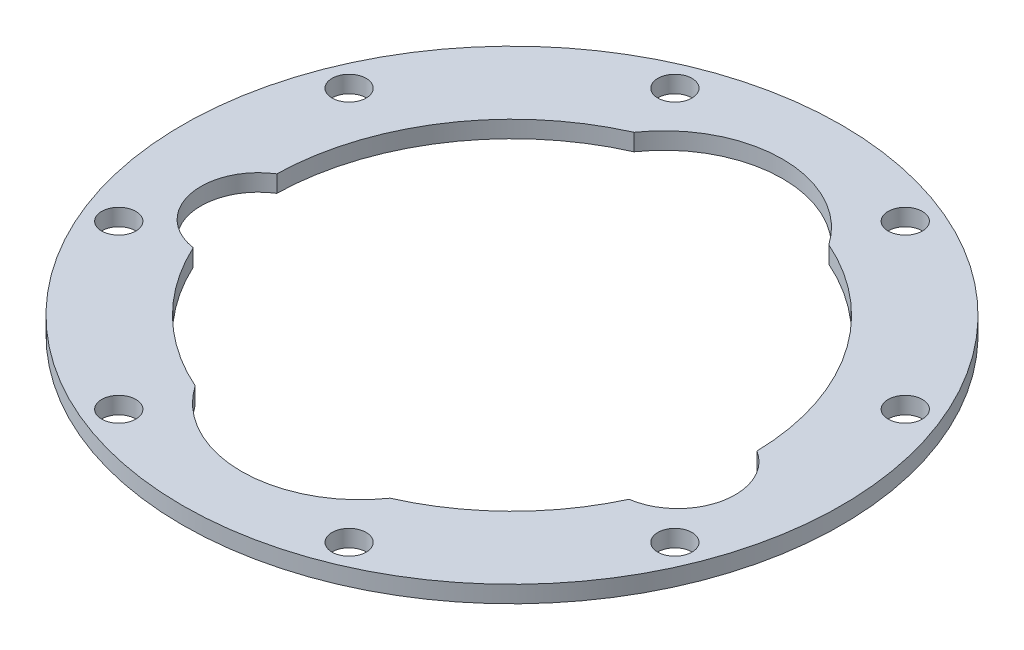
ISO-10303-21;
HEADER;
FILE_DESCRIPTION(('STEP AP214'),'2;1');
FILE_NAME('part.step','',(''),(''),'','','');
FILE_SCHEMA(('AUTOMOTIVE_DESIGN { 1 0 10303 214 1 1 1 1 }'));
ENDSEC;
DATA;
#1=APPLICATION_CONTEXT('core data for automotive mechanical design processes');
#2=APPLICATION_PROTOCOL_DEFINITION('international standard','automotive_design',2000,#1);
#3=PRODUCT_CONTEXT('',#1,'mechanical');
#4=PRODUCT('Part','Part','',(#3));
#5=PRODUCT_RELATED_PRODUCT_CATEGORY('part','',(#4));
#6=PRODUCT_DEFINITION_FORMATION('','',#4);
#7=PRODUCT_DEFINITION_CONTEXT('part definition',#1,'design');
#8=PRODUCT_DEFINITION('design','',#6,#7);
#9=PRODUCT_DEFINITION_SHAPE('','',#8);
#10=(LENGTH_UNIT() NAMED_UNIT(*) SI_UNIT(.MILLI.,.METRE.));
#11=(NAMED_UNIT(*) PLANE_ANGLE_UNIT() SI_UNIT($,.RADIAN.));
#12=(NAMED_UNIT(*) SI_UNIT($,.STERADIAN.) SOLID_ANGLE_UNIT());
#13=UNCERTAINTY_MEASURE_WITH_UNIT(LENGTH_MEASURE(1.E-05),#10,'distance_accuracy_value','');
#14=(GEOMETRIC_REPRESENTATION_CONTEXT(3) GLOBAL_UNCERTAINTY_ASSIGNED_CONTEXT((#13)) GLOBAL_UNIT_ASSIGNED_CONTEXT((#10,
#11,#12)) REPRESENTATION_CONTEXT('',''));
#15=CARTESIAN_POINT('',(0.,0.,0.));
#16=DIRECTION('',(0.,0.,1.));
#17=DIRECTION('',(1.,0.,0.));
#18=AXIS2_PLACEMENT_3D('',#15,#16,#17);
#19=CARTESIAN_POINT('',(0.,5.,0.));
#20=DIRECTION('',(0.,-1.,0.));
#21=DIRECTION('',(0.,0.,-1.));
#22=AXIS2_PLACEMENT_3D('',#19,#20,#21);
#23=CYLINDRICAL_SURFACE('',#22,71.);
#24=CARTESIAN_POINT('',(0.,0.,0.));
#25=DIRECTION('',(0.,1.,0.));
#26=DIRECTION('',(0.,0.,1.));
#27=AXIS2_PLACEMENT_3D('',#24,#25,#26);
#28=CIRCLE('',#27,71.);
#29=CARTESIAN_POINT('',(-28.7921864400743,0.,-64.9));
#30=VERTEX_POINT('',#29);
#31=CARTESIAN_POINT('',(-70.9855736985832,0.,-1.43119763939675));
#32=VERTEX_POINT('',#31);
#33=EDGE_CURVE('E196',#30,#32,#28,.T.);
#34=ORIENTED_EDGE('',*,*,#33,.F.);
#35=DIRECTION('',(0.,-1.,0.));
#36=VECTOR('',#35,1.);
#37=CARTESIAN_POINT('',(-28.7921864400743,5.,-64.9));
#38=LINE('',#37,#36);
#39=CARTESIAN_POINT('',(-28.7921864400743,5.,-64.9));
#40=VERTEX_POINT('',#39);
#41=EDGE_CURVE('E11',#40,#30,#38,.T.);
#42=ORIENTED_EDGE('',*,*,#41,.F.);
#43=CARTESIAN_POINT('',(0.,5.,0.));
#44=DIRECTION('',(0.,1.,0.));
#45=DIRECTION('',(0.,0.,1.));
#46=AXIS2_PLACEMENT_3D('',#43,#44,#45);
#47=CIRCLE('',#46,71.);
#48=CARTESIAN_POINT('',(-70.9855736985832,5.,-1.43119763939675));
#49=VERTEX_POINT('',#48);
#50=EDGE_CURVE('E136',#40,#49,#47,.T.);
#51=ORIENTED_EDGE('',*,*,#50,.T.);
#52=DIRECTION('',(0.,-1.,0.));
#53=VECTOR('',#52,1.);
#54=CARTESIAN_POINT('',(-70.9855736985832,5.,-1.43119763939675));
#55=LINE('',#54,#53);
#56=EDGE_CURVE('E59',#49,#32,#55,.T.);
#57=ORIENTED_EDGE('',*,*,#56,.T.);
#58=EDGE_LOOP('',(#34,#42,#51,#57));
#59=FACE_BOUND('',#58,.T.);
#60=ADVANCED_FACE('F41',(#59),#23,.F.);
#61=CARTESIAN_POINT('',(0.,5.,-45.));
#62=DIRECTION('',(0.,-1.,0.));
#63=DIRECTION('',(0.,0.,-1.));
#64=AXIS2_PLACEMENT_3D('',#61,#62,#63);
#65=CYLINDRICAL_SURFACE('',#64,35.);
#66=CARTESIAN_POINT('',(0.,0.,-45.));
#67=DIRECTION('',(0.,1.,0.));
#68=DIRECTION('',(0.,0.,1.));
#69=AXIS2_PLACEMENT_3D('',#66,#67,#68);
#70=CIRCLE('',#69,35.);
#71=CARTESIAN_POINT('',(28.7921864400743,0.,-64.9));
#72=VERTEX_POINT('',#71);
#73=EDGE_CURVE('E199',#30,#72,#70,.F.);
#74=ORIENTED_EDGE('',*,*,#73,.T.);
#75=DIRECTION('',(0.,-1.,0.));
#76=VECTOR('',#75,1.);
#77=CARTESIAN_POINT('',(28.7921864400743,5.,-64.9));
#78=LINE('',#77,#76);
#79=CARTESIAN_POINT('',(28.7921864400743,5.,-64.9));
#80=VERTEX_POINT('',#79);
#81=EDGE_CURVE('E51',#80,#72,#78,.T.);
#82=ORIENTED_EDGE('',*,*,#81,.F.);
#83=CARTESIAN_POINT('',(0.,5.,-45.));
#84=DIRECTION('',(0.,1.,0.));
#85=DIRECTION('',(0.,0.,1.));
#86=AXIS2_PLACEMENT_3D('',#83,#84,#85);
#87=CIRCLE('',#86,35.);
#88=EDGE_CURVE('E145',#40,#80,#87,.F.);
#89=ORIENTED_EDGE('',*,*,#88,.F.);
#90=ORIENTED_EDGE('',*,*,#41,.T.);
#91=EDGE_LOOP('',(#74,#82,#89,#90));
#92=FACE_BOUND('',#91,.T.);
#93=ADVANCED_FACE('F235',(#92),#65,.F.);
#94=CARTESIAN_POINT('',(70.9855736985832,0.,-1.43119763939679));
#95=VERTEX_POINT('',#94);
#96=EDGE_CURVE('E201',#95,#72,#28,.T.);
#97=ORIENTED_EDGE('',*,*,#96,.F.);
#98=DIRECTION('',(0.,-1.,0.));
#99=VECTOR('',#98,1.);
#100=CARTESIAN_POINT('',(70.9855736985832,5.,-1.43119763939679));
#101=LINE('',#100,#99);
#102=CARTESIAN_POINT('',(70.9855736985832,5.,-1.43119763939679));
#103=VERTEX_POINT('',#102);
#104=EDGE_CURVE('E226',#103,#95,#101,.T.);
#105=ORIENTED_EDGE('',*,*,#104,.F.);
#106=EDGE_CURVE('E143',#103,#80,#47,.T.);
#107=ORIENTED_EDGE('',*,*,#106,.T.);
#108=ORIENTED_EDGE('',*,*,#81,.T.);
#109=EDGE_LOOP('',(#97,#105,#107,#108));
#110=FACE_BOUND('',#109,.T.);
#111=ADVANCED_FACE('F231',(#110),#23,.F.);
#112=CARTESIAN_POINT('',(62.,5.,13.));
#113=DIRECTION('',(0.,-1.,0.));
#114=DIRECTION('',(0.,0.,-1.));
#115=AXIS2_PLACEMENT_3D('',#112,#113,#114);
#116=CYLINDRICAL_SURFACE('',#115,17.);
#117=CARTESIAN_POINT('',(62.,0.,13.));
#118=DIRECTION('',(0.,1.,0.));
#119=DIRECTION('',(0.,0.,1.));
#120=AXIS2_PLACEMENT_3D('',#117,#118,#119);
#121=CIRCLE('',#120,17.);
#122=CARTESIAN_POINT('',(64.4318197726353,0.,29.8251672382007));
#123=VERTEX_POINT('',#122);
#124=EDGE_CURVE('E205',#95,#123,#121,.F.);
#125=ORIENTED_EDGE('',*,*,#124,.T.);
#126=DIRECTION('',(0.,-1.,0.));
#127=VECTOR('',#126,1.);
#128=CARTESIAN_POINT('',(64.4318197726353,5.,29.8251672382007));
#129=LINE('',#128,#127);
#130=CARTESIAN_POINT('',(64.4318197726353,5.,29.8251672382007));
#131=VERTEX_POINT('',#130);
#132=EDGE_CURVE('E223',#131,#123,#129,.T.);
#133=ORIENTED_EDGE('',*,*,#132,.F.);
#134=CARTESIAN_POINT('',(62.,5.,13.));
#135=DIRECTION('',(0.,1.,0.));
#136=DIRECTION('',(0.,0.,1.));
#137=AXIS2_PLACEMENT_3D('',#134,#135,#136);
#138=CIRCLE('',#137,17.);
#139=EDGE_CURVE('E142',#103,#131,#138,.F.);
#140=ORIENTED_EDGE('',*,*,#139,.F.);
#141=ORIENTED_EDGE('',*,*,#104,.T.);
#142=EDGE_LOOP('',(#125,#133,#140,#141));
#143=FACE_BOUND('',#142,.T.);
#144=ADVANCED_FACE('F264',(#143),#116,.F.);
#145=CARTESIAN_POINT('',(28.7921864400743,0.,64.9));
#146=VERTEX_POINT('',#145);
#147=EDGE_CURVE('E209',#146,#123,#28,.T.);
#148=ORIENTED_EDGE('',*,*,#147,.F.);
#149=DIRECTION('',(0.,-1.,0.));
#150=VECTOR('',#149,1.);
#151=CARTESIAN_POINT('',(28.7921864400743,5.,64.9));
#152=LINE('',#151,#150);
#153=CARTESIAN_POINT('',(28.7921864400743,5.,64.9));
#154=VERTEX_POINT('',#153);
#155=EDGE_CURVE('E119',#154,#146,#152,.T.);
#156=ORIENTED_EDGE('',*,*,#155,.F.);
#157=EDGE_CURVE('E129',#154,#131,#47,.T.);
#158=ORIENTED_EDGE('',*,*,#157,.T.);
#159=ORIENTED_EDGE('',*,*,#132,.T.);
#160=EDGE_LOOP('',(#148,#156,#158,#159));
#161=FACE_BOUND('',#160,.T.);
#162=ADVANCED_FACE('F265',(#161),#23,.F.);
#163=CARTESIAN_POINT('',(0.,5.,45.));
#164=DIRECTION('',(0.,-1.,0.));
#165=DIRECTION('',(0.,0.,-1.));
#166=AXIS2_PLACEMENT_3D('',#163,#164,#165);
#167=CYLINDRICAL_SURFACE('',#166,35.);
#168=CARTESIAN_POINT('',(0.,0.,45.));
#169=DIRECTION('',(0.,1.,0.));
#170=DIRECTION('',(0.,0.,1.));
#171=AXIS2_PLACEMENT_3D('',#168,#169,#170);
#172=CIRCLE('',#171,35.);
#173=CARTESIAN_POINT('',(-28.7921864400743,0.,64.9));
#174=VERTEX_POINT('',#173);
#175=EDGE_CURVE('E114',#174,#146,#172,.T.);
#176=ORIENTED_EDGE('',*,*,#175,.F.);
#177=DIRECTION('',(0.,-1.,0.));
#178=VECTOR('',#177,1.);
#179=CARTESIAN_POINT('',(-28.7921864400743,5.,64.9));
#180=LINE('',#179,#178);
#181=CARTESIAN_POINT('',(-28.7921864400743,5.,64.9));
#182=VERTEX_POINT('',#181);
#183=EDGE_CURVE('E109',#182,#174,#180,.T.);
#184=ORIENTED_EDGE('',*,*,#183,.F.);
#185=CARTESIAN_POINT('',(0.,5.,45.));
#186=DIRECTION('',(0.,1.,0.));
#187=DIRECTION('',(0.,0.,1.));
#188=AXIS2_PLACEMENT_3D('',#185,#186,#187);
#189=CIRCLE('',#188,35.);
#190=EDGE_CURVE('E112',#182,#154,#189,.T.);
#191=ORIENTED_EDGE('',*,*,#190,.T.);
#192=ORIENTED_EDGE('',*,*,#155,.T.);
#193=EDGE_LOOP('',(#176,#184,#191,#192));
#194=FACE_BOUND('',#193,.T.);
#195=ADVANCED_FACE('F111',(#194),#167,.F.);
#196=CARTESIAN_POINT('',(-64.4318197726353,0.,29.8251672382006));
#197=VERTEX_POINT('',#196);
#198=EDGE_CURVE('E200',#197,#174,#28,.T.);
#199=ORIENTED_EDGE('',*,*,#198,.F.);
#200=DIRECTION('',(0.,-1.,0.));
#201=VECTOR('',#200,1.);
#202=CARTESIAN_POINT('',(-64.4318197726353,5.,29.8251672382006));
#203=LINE('',#202,#201);
#204=CARTESIAN_POINT('',(-64.4318197726353,5.,29.8251672382006));
#205=VERTEX_POINT('',#204);
#206=EDGE_CURVE('E84',#205,#197,#203,.T.);
#207=ORIENTED_EDGE('',*,*,#206,.F.);
#208=EDGE_CURVE('E127',#205,#182,#47,.T.);
#209=ORIENTED_EDGE('',*,*,#208,.T.);
#210=ORIENTED_EDGE('',*,*,#183,.T.);
#211=EDGE_LOOP('',(#199,#207,#209,#210));
#212=FACE_BOUND('',#211,.T.);
#213=ADVANCED_FACE('F132',(#212),#23,.F.);
#214=CARTESIAN_POINT('',(0.,5.,0.));
#215=DIRECTION('',(0.,-1.,0.));
#216=DIRECTION('',(0.,0.,-1.));
#217=AXIS2_PLACEMENT_3D('',#214,#215,#216);
#218=CYLINDRICAL_SURFACE('',#217,97.45);
#219=CARTESIAN_POINT('',(0.,5.,0.));
#220=DIRECTION('',(0.,1.,0.));
#221=DIRECTION('',(0.,0.,1.));
#222=AXIS2_PLACEMENT_3D('',#219,#220,#221);
#223=CIRCLE('',#222,97.45);
#224=CARTESIAN_POINT('',(0.,5.,97.45));
#225=VERTEX_POINT('',#224);
#226=EDGE_CURVE('E146',#225,#225,#223,.T.);
#227=ORIENTED_EDGE('',*,*,#226,.F.);
#228=EDGE_LOOP('',(#227));
#229=FACE_BOUND('',#228,.T.);
#230=CARTESIAN_POINT('',(0.,0.,0.));
#231=DIRECTION('',(0.,1.,0.));
#232=DIRECTION('',(0.,0.,1.));
#233=AXIS2_PLACEMENT_3D('',#230,#231,#232);
#234=CIRCLE('',#233,97.45);
#235=CARTESIAN_POINT('',(0.,0.,97.45));
#236=VERTEX_POINT('',#235);
#237=EDGE_CURVE('E192',#236,#236,#234,.T.);
#238=ORIENTED_EDGE('',*,*,#237,.T.);
#239=EDGE_LOOP('',(#238));
#240=FACE_BOUND('',#239,.T.);
#241=ADVANCED_FACE('F267',(#229,#240),#218,.T.);
#242=CARTESIAN_POINT('',(-34.0588254804925,5.,-82.2252783935047));
#243=DIRECTION('',(0.,-1.,0.));
#244=DIRECTION('',(0.,0.,-1.));
#245=AXIS2_PLACEMENT_3D('',#242,#243,#244);
#246=CYLINDRICAL_SURFACE('',#245,5.05);
#247=CARTESIAN_POINT('',(-34.0588254804925,5.,-82.2252783935047));
#248=DIRECTION('',(0.,1.,0.));
#249=DIRECTION('',(0.,0.,1.));
#250=AXIS2_PLACEMENT_3D('',#247,#248,#249);
#251=CIRCLE('',#250,5.05);
#252=CARTESIAN_POINT('',(-34.0588254804925,5.,-77.1752783935047));
#253=VERTEX_POINT('',#252);
#254=EDGE_CURVE('E150',#253,#253,#251,.T.);
#255=ORIENTED_EDGE('',*,*,#254,.T.);
#256=EDGE_LOOP('',(#255));
#257=FACE_BOUND('',#256,.T.);
#258=CARTESIAN_POINT('',(-34.0588254804925,0.,-82.2252783935047));
#259=DIRECTION('',(0.,1.,0.));
#260=DIRECTION('',(0.,0.,1.));
#261=AXIS2_PLACEMENT_3D('',#258,#259,#260);
#262=CIRCLE('',#261,5.05);
#263=CARTESIAN_POINT('',(-34.0588254804925,0.,-77.1752783935047));
#264=VERTEX_POINT('',#263);
#265=EDGE_CURVE('E188',#264,#264,#262,.T.);
#266=ORIENTED_EDGE('',*,*,#265,.F.);
#267=EDGE_LOOP('',(#266));
#268=FACE_BOUND('',#267,.T.);
#269=ADVANCED_FACE('F272',(#257,#268),#246,.F.);
#270=CARTESIAN_POINT('',(34.0588254804935,5.,-82.2252783935043));
#271=DIRECTION('',(0.,-1.,0.));
#272=DIRECTION('',(0.,0.,-1.));
#273=AXIS2_PLACEMENT_3D('',#270,#271,#272);
#274=CYLINDRICAL_SURFACE('',#273,5.05);
#275=CARTESIAN_POINT('',(34.0588254804935,5.,-82.2252783935043));
#276=DIRECTION('',(0.,1.,0.));
#277=DIRECTION('',(0.,0.,1.));
#278=AXIS2_PLACEMENT_3D('',#275,#276,#277);
#279=CIRCLE('',#278,5.05);
#280=CARTESIAN_POINT('',(34.0588254804935,5.,-77.1752783935043));
#281=VERTEX_POINT('',#280);
#282=EDGE_CURVE('E467',#281,#281,#279,.T.);
#283=ORIENTED_EDGE('',*,*,#282,.T.);
#284=EDGE_LOOP('',(#283));
#285=FACE_BOUND('',#284,.T.);
#286=CARTESIAN_POINT('',(34.0588254804935,0.,-82.2252783935043));
#287=DIRECTION('',(0.,1.,0.));
#288=DIRECTION('',(0.,0.,1.));
#289=AXIS2_PLACEMENT_3D('',#286,#287,#288);
#290=CIRCLE('',#289,5.05);
#291=CARTESIAN_POINT('',(34.0588254804935,0.,-77.1752783935043));
#292=VERTEX_POINT('',#291);
#293=EDGE_CURVE('E184',#292,#292,#290,.T.);
#294=ORIENTED_EDGE('',*,*,#293,.F.);
#295=EDGE_LOOP('',(#294));
#296=FACE_BOUND('',#295,.T.);
#297=ADVANCED_FACE('F287',(#285,#296),#274,.F.);
#298=CARTESIAN_POINT('',(82.2252783935047,5.,-34.0588254804925));
#299=DIRECTION('',(0.,-1.,0.));
#300=DIRECTION('',(0.,0.,-1.));
#301=AXIS2_PLACEMENT_3D('',#298,#299,#300);
#302=CYLINDRICAL_SURFACE('',#301,5.05);
#303=CARTESIAN_POINT('',(82.2252783935047,5.,-34.0588254804925));
#304=DIRECTION('',(0.,1.,0.));
#305=DIRECTION('',(0.,0.,1.));
#306=AXIS2_PLACEMENT_3D('',#303,#304,#305);
#307=CIRCLE('',#306,5.05);
#308=CARTESIAN_POINT('',(82.2252783935047,5.,-29.0088254804925));
#309=VERTEX_POINT('',#308);
#310=EDGE_CURVE('E463',#309,#309,#307,.T.);
#311=ORIENTED_EDGE('',*,*,#310,.T.);
#312=EDGE_LOOP('',(#311));
#313=FACE_BOUND('',#312,.T.);
#314=CARTESIAN_POINT('',(82.2252783935047,0.,-34.0588254804925));
#315=DIRECTION('',(0.,1.,0.));
#316=DIRECTION('',(0.,0.,1.));
#317=AXIS2_PLACEMENT_3D('',#314,#315,#316);
#318=CIRCLE('',#317,5.05);
#319=CARTESIAN_POINT('',(82.2252783935047,0.,-29.0088254804925));
#320=VERTEX_POINT('',#319);
#321=EDGE_CURVE('E180',#320,#320,#318,.T.);
#322=ORIENTED_EDGE('',*,*,#321,.F.);
#323=EDGE_LOOP('',(#322));
#324=FACE_BOUND('',#323,.T.);
#325=ADVANCED_FACE('F291',(#313,#324),#302,.F.);
#326=CARTESIAN_POINT('',(82.2252783935043,5.,34.0588254804935));
#327=DIRECTION('',(0.,-1.,0.));
#328=DIRECTION('',(0.,0.,-1.));
#329=AXIS2_PLACEMENT_3D('',#326,#327,#328);
#330=CYLINDRICAL_SURFACE('',#329,5.05);
#331=CARTESIAN_POINT('',(82.2252783935043,5.,34.0588254804935));
#332=DIRECTION('',(0.,1.,0.));
#333=DIRECTION('',(0.,0.,1.));
#334=AXIS2_PLACEMENT_3D('',#331,#332,#333);
#335=CIRCLE('',#334,5.05);
#336=CARTESIAN_POINT('',(82.2252783935043,5.,39.1088254804935));
#337=VERTEX_POINT('',#336);
#338=EDGE_CURVE('E459',#337,#337,#335,.T.);
#339=ORIENTED_EDGE('',*,*,#338,.T.);
#340=EDGE_LOOP('',(#339));
#341=FACE_BOUND('',#340,.T.);
#342=CARTESIAN_POINT('',(82.2252783935043,0.,34.0588254804935));
#343=DIRECTION('',(0.,1.,0.));
#344=DIRECTION('',(0.,0.,1.));
#345=AXIS2_PLACEMENT_3D('',#342,#343,#344);
#346=CIRCLE('',#345,5.05);
#347=CARTESIAN_POINT('',(82.2252783935043,0.,39.1088254804935));
#348=VERTEX_POINT('',#347);
#349=EDGE_CURVE('E176',#348,#348,#346,.T.);
#350=ORIENTED_EDGE('',*,*,#349,.F.);
#351=EDGE_LOOP('',(#350));
#352=FACE_BOUND('',#351,.T.);
#353=ADVANCED_FACE('F295',(#341,#352),#330,.F.);
#354=CARTESIAN_POINT('',(34.0588254804925,5.,82.2252783935047));
#355=DIRECTION('',(0.,-1.,0.));
#356=DIRECTION('',(0.,0.,-1.));
#357=AXIS2_PLACEMENT_3D('',#354,#355,#356);
#358=CYLINDRICAL_SURFACE('',#357,5.05);
#359=CARTESIAN_POINT('',(34.0588254804925,5.,82.2252783935047));
#360=DIRECTION('',(0.,1.,0.));
#361=DIRECTION('',(0.,0.,1.));
#362=AXIS2_PLACEMENT_3D('',#359,#360,#361);
#363=CIRCLE('',#362,5.05);
#364=CARTESIAN_POINT('',(34.0588254804925,5.,87.2752783935047));
#365=VERTEX_POINT('',#364);
#366=EDGE_CURVE('E451',#365,#365,#363,.T.);
#367=ORIENTED_EDGE('',*,*,#366,.T.);
#368=EDGE_LOOP('',(#367));
#369=FACE_BOUND('',#368,.T.);
#370=CARTESIAN_POINT('',(34.0588254804925,0.,82.2252783935047));
#371=DIRECTION('',(0.,1.,0.));
#372=DIRECTION('',(0.,0.,1.));
#373=AXIS2_PLACEMENT_3D('',#370,#371,#372);
#374=CIRCLE('',#373,5.05);
#375=CARTESIAN_POINT('',(34.0588254804925,0.,87.2752783935047));
#376=VERTEX_POINT('',#375);
#377=EDGE_CURVE('E172',#376,#376,#374,.T.);
#378=ORIENTED_EDGE('',*,*,#377,.F.);
#379=EDGE_LOOP('',(#378));
#380=FACE_BOUND('',#379,.T.);
#381=ADVANCED_FACE('F299',(#369,#380),#358,.F.);
#382=CARTESIAN_POINT('',(-34.0588254804935,5.,82.2252783935043));
#383=DIRECTION('',(0.,-1.,0.));
#384=DIRECTION('',(0.,0.,-1.));
#385=AXIS2_PLACEMENT_3D('',#382,#383,#384);
#386=CYLINDRICAL_SURFACE('',#385,5.05);
#387=CARTESIAN_POINT('',(-34.0588254804935,5.,82.2252783935043));
#388=DIRECTION('',(0.,1.,0.));
#389=DIRECTION('',(0.,0.,1.));
#390=AXIS2_PLACEMENT_3D('',#387,#388,#389);
#391=CIRCLE('',#390,5.05);
#392=CARTESIAN_POINT('',(-34.0588254804935,5.,87.2752783935043));
#393=VERTEX_POINT('',#392);
#394=EDGE_CURVE('E446',#393,#393,#391,.T.);
#395=ORIENTED_EDGE('',*,*,#394,.T.);
#396=EDGE_LOOP('',(#395));
#397=FACE_BOUND('',#396,.T.);
#398=CARTESIAN_POINT('',(-34.0588254804935,0.,82.2252783935043));
#399=DIRECTION('',(0.,1.,0.));
#400=DIRECTION('',(0.,0.,1.));
#401=AXIS2_PLACEMENT_3D('',#398,#399,#400);
#402=CIRCLE('',#401,5.05);
#403=CARTESIAN_POINT('',(-34.0588254804935,0.,87.2752783935043));
#404=VERTEX_POINT('',#403);
#405=EDGE_CURVE('E168',#404,#404,#402,.T.);
#406=ORIENTED_EDGE('',*,*,#405,.F.);
#407=EDGE_LOOP('',(#406));
#408=FACE_BOUND('',#407,.T.);
#409=ADVANCED_FACE('F303',(#397,#408),#386,.F.);
#410=CARTESIAN_POINT('',(-82.2252783935047,5.,34.0588254804925));
#411=DIRECTION('',(0.,-1.,0.));
#412=DIRECTION('',(0.,0.,-1.));
#413=AXIS2_PLACEMENT_3D('',#410,#411,#412);
#414=CYLINDRICAL_SURFACE('',#413,5.05);
#415=CARTESIAN_POINT('',(-82.2252783935047,5.,34.0588254804925));
#416=DIRECTION('',(0.,1.,0.));
#417=DIRECTION('',(0.,0.,1.));
#418=AXIS2_PLACEMENT_3D('',#415,#416,#417);
#419=CIRCLE('',#418,5.05);
#420=CARTESIAN_POINT('',(-82.2252783935047,5.,39.1088254804925));
#421=VERTEX_POINT('',#420);
#422=EDGE_CURVE('E314',#421,#421,#419,.T.);
#423=ORIENTED_EDGE('',*,*,#422,.T.);
#424=EDGE_LOOP('',(#423));
#425=FACE_BOUND('',#424,.T.);
#426=CARTESIAN_POINT('',(-82.2252783935047,0.,34.0588254804925));
#427=DIRECTION('',(0.,1.,0.));
#428=DIRECTION('',(0.,0.,1.));
#429=AXIS2_PLACEMENT_3D('',#426,#427,#428);
#430=CIRCLE('',#429,5.05);
#431=CARTESIAN_POINT('',(-82.2252783935047,0.,39.1088254804925));
#432=VERTEX_POINT('',#431);
#433=EDGE_CURVE('E164',#432,#432,#430,.T.);
#434=ORIENTED_EDGE('',*,*,#433,.F.);
#435=EDGE_LOOP('',(#434));
#436=FACE_BOUND('',#435,.T.);
#437=ADVANCED_FACE('F253',(#425,#436),#414,.F.);
#438=CARTESIAN_POINT('',(-82.2252783935043,5.,-34.0588254804935));
#439=DIRECTION('',(0.,-1.,0.));
#440=DIRECTION('',(0.,0.,-1.));
#441=AXIS2_PLACEMENT_3D('',#438,#439,#440);
#442=CYLINDRICAL_SURFACE('',#441,5.05);
#443=CARTESIAN_POINT('',(-82.2252783935043,5.,-34.0588254804935));
#444=DIRECTION('',(0.,1.,0.));
#445=DIRECTION('',(0.,0.,1.));
#446=AXIS2_PLACEMENT_3D('',#443,#444,#445);
#447=CIRCLE('',#446,5.05);
#448=CARTESIAN_POINT('',(-82.2252783935043,5.,-29.0088254804935));
#449=VERTEX_POINT('',#448);
#450=EDGE_CURVE('E216',#449,#449,#447,.T.);
#451=ORIENTED_EDGE('',*,*,#450,.T.);
#452=EDGE_LOOP('',(#451));
#453=FACE_BOUND('',#452,.T.);
#454=CARTESIAN_POINT('',(-82.2252783935043,0.,-34.0588254804935));
#455=DIRECTION('',(0.,1.,0.));
#456=DIRECTION('',(0.,0.,1.));
#457=AXIS2_PLACEMENT_3D('',#454,#455,#456);
#458=CIRCLE('',#457,5.05);
#459=CARTESIAN_POINT('',(-82.2252783935043,0.,-29.0088254804935));
#460=VERTEX_POINT('',#459);
#461=EDGE_CURVE('E160',#460,#460,#458,.T.);
#462=ORIENTED_EDGE('',*,*,#461,.F.);
#463=EDGE_LOOP('',(#462));
#464=FACE_BOUND('',#463,.T.);
#465=ADVANCED_FACE('F43',(#453,#464),#442,.F.);
#466=CARTESIAN_POINT('',(-62.,5.,13.));
#467=DIRECTION('',(0.,-1.,0.));
#468=DIRECTION('',(0.,0.,-1.));
#469=AXIS2_PLACEMENT_3D('',#466,#467,#468);
#470=CYLINDRICAL_SURFACE('',#469,17.);
#471=CARTESIAN_POINT('',(-62.,0.,13.));
#472=DIRECTION('',(0.,1.,0.));
#473=DIRECTION('',(0.,0.,1.));
#474=AXIS2_PLACEMENT_3D('',#471,#472,#473);
#475=CIRCLE('',#474,17.);
#476=EDGE_CURVE('E212',#32,#197,#475,.T.);
#477=ORIENTED_EDGE('',*,*,#476,.F.);
#478=ORIENTED_EDGE('',*,*,#56,.F.);
#479=CARTESIAN_POINT('',(-62.,5.,13.));
#480=DIRECTION('',(0.,1.,0.));
#481=DIRECTION('',(0.,0.,1.));
#482=AXIS2_PLACEMENT_3D('',#479,#480,#481);
#483=CIRCLE('',#482,17.);
#484=EDGE_CURVE('E134',#49,#205,#483,.T.);
#485=ORIENTED_EDGE('',*,*,#484,.T.);
#486=ORIENTED_EDGE('',*,*,#206,.T.);
#487=EDGE_LOOP('',(#477,#478,#485,#486));
#488=FACE_BOUND('',#487,.T.);
#489=ADVANCED_FACE('F244',(#488),#470,.F.);
#490=CARTESIAN_POINT('',(0.,5.,0.));
#491=DIRECTION('',(0.,1.,0.));
#492=DIRECTION('',(0.,0.,1.));
#493=AXIS2_PLACEMENT_3D('',#490,#491,#492);
#494=PLANE('',#493);
#495=ORIENTED_EDGE('',*,*,#450,.F.);
#496=EDGE_LOOP('',(#495));
#497=FACE_BOUND('',#496,.T.);
#498=ORIENTED_EDGE('',*,*,#422,.F.);
#499=EDGE_LOOP('',(#498));
#500=FACE_BOUND('',#499,.T.);
#501=ORIENTED_EDGE('',*,*,#394,.F.);
#502=EDGE_LOOP('',(#501));
#503=FACE_BOUND('',#502,.T.);
#504=ORIENTED_EDGE('',*,*,#366,.F.);
#505=EDGE_LOOP('',(#504));
#506=FACE_BOUND('',#505,.T.);
#507=ORIENTED_EDGE('',*,*,#338,.F.);
#508=EDGE_LOOP('',(#507));
#509=FACE_BOUND('',#508,.T.);
#510=ORIENTED_EDGE('',*,*,#310,.F.);
#511=EDGE_LOOP('',(#510));
#512=FACE_BOUND('',#511,.T.);
#513=ORIENTED_EDGE('',*,*,#282,.F.);
#514=EDGE_LOOP('',(#513));
#515=FACE_BOUND('',#514,.T.);
#516=ORIENTED_EDGE('',*,*,#254,.F.);
#517=EDGE_LOOP('',(#516));
#518=FACE_BOUND('',#517,.T.);
#519=ORIENTED_EDGE('',*,*,#226,.T.);
#520=EDGE_LOOP('',(#519));
#521=FACE_BOUND('',#520,.T.);
#522=ORIENTED_EDGE('',*,*,#50,.F.);
#523=ORIENTED_EDGE('',*,*,#88,.T.);
#524=ORIENTED_EDGE('',*,*,#106,.F.);
#525=ORIENTED_EDGE('',*,*,#139,.T.);
#526=ORIENTED_EDGE('',*,*,#157,.F.);
#527=ORIENTED_EDGE('',*,*,#190,.F.);
#528=ORIENTED_EDGE('',*,*,#208,.F.);
#529=ORIENTED_EDGE('',*,*,#484,.F.);
#530=EDGE_LOOP('',(#522,#523,#524,#525,#526,#527,#528,#529));
#531=FACE_BOUND('',#530,.T.);
#532=ADVANCED_FACE('F125',(#497,#500,#503,#506,#509,#512,#515,#518,#521,#531),#494,.T.);
#533=CARTESIAN_POINT('',(0.,0.,0.));
#534=DIRECTION('',(0.,1.,0.));
#535=DIRECTION('',(0.,0.,1.));
#536=AXIS2_PLACEMENT_3D('',#533,#534,#535);
#537=PLANE('',#536);
#538=ORIENTED_EDGE('',*,*,#461,.T.);
#539=EDGE_LOOP('',(#538));
#540=FACE_BOUND('',#539,.T.);
#541=ORIENTED_EDGE('',*,*,#433,.T.);
#542=EDGE_LOOP('',(#541));
#543=FACE_BOUND('',#542,.T.);
#544=ORIENTED_EDGE('',*,*,#405,.T.);
#545=EDGE_LOOP('',(#544));
#546=FACE_BOUND('',#545,.T.);
#547=ORIENTED_EDGE('',*,*,#377,.T.);
#548=EDGE_LOOP('',(#547));
#549=FACE_BOUND('',#548,.T.);
#550=ORIENTED_EDGE('',*,*,#349,.T.);
#551=EDGE_LOOP('',(#550));
#552=FACE_BOUND('',#551,.T.);
#553=ORIENTED_EDGE('',*,*,#321,.T.);
#554=EDGE_LOOP('',(#553));
#555=FACE_BOUND('',#554,.T.);
#556=ORIENTED_EDGE('',*,*,#293,.T.);
#557=EDGE_LOOP('',(#556));
#558=FACE_BOUND('',#557,.T.);
#559=ORIENTED_EDGE('',*,*,#265,.T.);
#560=EDGE_LOOP('',(#559));
#561=FACE_BOUND('',#560,.T.);
#562=ORIENTED_EDGE('',*,*,#237,.F.);
#563=EDGE_LOOP('',(#562));
#564=FACE_BOUND('',#563,.T.);
#565=ORIENTED_EDGE('',*,*,#33,.T.);
#566=ORIENTED_EDGE('',*,*,#476,.T.);
#567=ORIENTED_EDGE('',*,*,#198,.T.);
#568=ORIENTED_EDGE('',*,*,#175,.T.);
#569=ORIENTED_EDGE('',*,*,#147,.T.);
#570=ORIENTED_EDGE('',*,*,#124,.F.);
#571=ORIENTED_EDGE('',*,*,#96,.T.);
#572=ORIENTED_EDGE('',*,*,#73,.F.);
#573=EDGE_LOOP('',(#565,#566,#567,#568,#569,#570,#571,#572));
#574=FACE_BOUND('',#573,.T.);
#575=ADVANCED_FACE('F238',(#540,#543,#546,#549,#552,#555,#558,#561,#564,#574),#537,.F.);
#576=CLOSED_SHELL('',(#60,#93,#111,#144,#162,#195,#213,#241,#269,#297,#325,#353,#381,#409,#437,
#465,#489,#532,#575));
#577=MANIFOLD_SOLID_BREP('B2',#576);
#578=ADVANCED_BREP_SHAPE_REPRESENTATION('',(#18,#577),#14);
#579=SHAPE_DEFINITION_REPRESENTATION(#9,#578);
ENDSEC;
END-ISO-10303-21;
